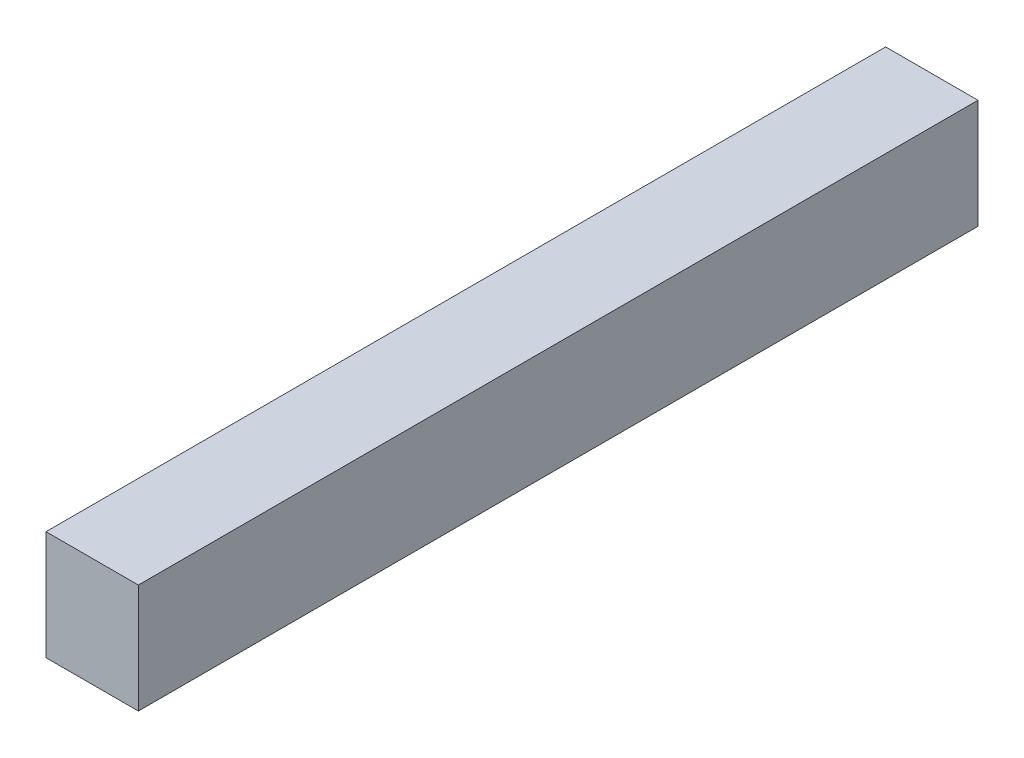
ISO-10303-21;
HEADER;
FILE_DESCRIPTION(('STEP AP214'),'2;1');
FILE_NAME('part.step','',(''),(''),'','','');
FILE_SCHEMA(('AUTOMOTIVE_DESIGN { 1 0 10303 214 1 1 1 1 }'));
ENDSEC;
DATA;
#1=APPLICATION_CONTEXT('core data for automotive mechanical design processes');
#2=APPLICATION_PROTOCOL_DEFINITION('international standard','automotive_design',2000,#1);
#3=PRODUCT_CONTEXT('',#1,'mechanical');
#4=PRODUCT('Part','Part','',(#3));
#5=PRODUCT_RELATED_PRODUCT_CATEGORY('part','',(#4));
#6=PRODUCT_DEFINITION_FORMATION('','',#4);
#7=PRODUCT_DEFINITION_CONTEXT('part definition',#1,'design');
#8=PRODUCT_DEFINITION('design','',#6,#7);
#9=PRODUCT_DEFINITION_SHAPE('','',#8);
#10=(LENGTH_UNIT() NAMED_UNIT(*) SI_UNIT(.MILLI.,.METRE.));
#11=(NAMED_UNIT(*) PLANE_ANGLE_UNIT() SI_UNIT($,.RADIAN.));
#12=(NAMED_UNIT(*) SI_UNIT($,.STERADIAN.) SOLID_ANGLE_UNIT());
#13=UNCERTAINTY_MEASURE_WITH_UNIT(LENGTH_MEASURE(1.E-05),#10,'distance_accuracy_value','');
#14=(GEOMETRIC_REPRESENTATION_CONTEXT(3) GLOBAL_UNCERTAINTY_ASSIGNED_CONTEXT((#13)) GLOBAL_UNIT_ASSIGNED_CONTEXT((#10,
#11,#12)) REPRESENTATION_CONTEXT('',''));
#15=CARTESIAN_POINT('',(0.,0.,0.));
#16=DIRECTION('',(0.,0.,1.));
#17=DIRECTION('',(1.,0.,0.));
#18=AXIS2_PLACEMENT_3D('',#15,#16,#17);
#19=CARTESIAN_POINT('',(1.375,1.625,25.));
#20=DIRECTION('',(-1.,0.,0.));
#21=DIRECTION('',(0.,-1.,0.));
#22=AXIS2_PLACEMENT_3D('',#19,#20,#21);
#23=PLANE('',#22);
#24=DIRECTION('',(0.,1.,0.));
#25=VECTOR('',#24,1.);
#26=CARTESIAN_POINT('',(1.375,1.625,0.));
#27=LINE('',#26,#25);
#28=CARTESIAN_POINT('',(1.375,-1.625,0.));
#29=VERTEX_POINT('',#28);
#30=CARTESIAN_POINT('',(1.375,1.625,0.));
#31=VERTEX_POINT('',#30);
#32=EDGE_CURVE('E107',#29,#31,#27,.T.);
#33=ORIENTED_EDGE('',*,*,#32,.T.);
#34=DIRECTION('',(0.,0.,-1.));
#35=VECTOR('',#34,1.);
#36=CARTESIAN_POINT('',(1.375,1.625,25.));
#37=LINE('',#36,#35);
#38=CARTESIAN_POINT('',(1.375,1.625,25.));
#39=VERTEX_POINT('',#38);
#40=EDGE_CURVE('E11',#39,#31,#37,.T.);
#41=ORIENTED_EDGE('',*,*,#40,.F.);
#42=DIRECTION('',(0.,1.,0.));
#43=VECTOR('',#42,1.);
#44=CARTESIAN_POINT('',(1.375,1.625,25.));
#45=LINE('',#44,#43);
#46=CARTESIAN_POINT('',(1.375,-1.625,25.));
#47=VERTEX_POINT('',#46);
#48=EDGE_CURVE('E91',#47,#39,#45,.T.);
#49=ORIENTED_EDGE('',*,*,#48,.F.);
#50=DIRECTION('',(0.,0.,-1.));
#51=VECTOR('',#50,1.);
#52=CARTESIAN_POINT('',(1.375,-1.625,25.));
#53=LINE('',#52,#51);
#54=EDGE_CURVE('E103',#47,#29,#53,.T.);
#55=ORIENTED_EDGE('',*,*,#54,.T.);
#56=EDGE_LOOP('',(#33,#41,#49,#55));
#57=FACE_BOUND('',#56,.T.);
#58=ADVANCED_FACE('F39',(#57),#23,.F.);
#59=CARTESIAN_POINT('',(-1.375,1.625,25.));
#60=DIRECTION('',(0.,-1.,0.));
#61=DIRECTION('',(0.,0.,-1.));
#62=AXIS2_PLACEMENT_3D('',#59,#60,#61);
#63=PLANE('',#62);
#64=DIRECTION('',(-1.,0.,0.));
#65=VECTOR('',#64,1.);
#66=CARTESIAN_POINT('',(-1.375,1.625,0.));
#67=LINE('',#66,#65);
#68=CARTESIAN_POINT('',(-1.375,1.625,0.));
#69=VERTEX_POINT('',#68);
#70=EDGE_CURVE('E96',#31,#69,#67,.T.);
#71=ORIENTED_EDGE('',*,*,#70,.T.);
#72=DIRECTION('',(0.,0.,-1.));
#73=VECTOR('',#72,1.);
#74=CARTESIAN_POINT('',(-1.375,1.625,25.));
#75=LINE('',#74,#73);
#76=CARTESIAN_POINT('',(-1.375,1.625,25.));
#77=VERTEX_POINT('',#76);
#78=EDGE_CURVE('E48',#77,#69,#75,.T.);
#79=ORIENTED_EDGE('',*,*,#78,.F.);
#80=DIRECTION('',(-1.,0.,0.));
#81=VECTOR('',#80,1.);
#82=CARTESIAN_POINT('',(-1.375,1.625,25.));
#83=LINE('',#82,#81);
#84=EDGE_CURVE('E86',#39,#77,#83,.T.);
#85=ORIENTED_EDGE('',*,*,#84,.F.);
#86=ORIENTED_EDGE('',*,*,#40,.T.);
#87=EDGE_LOOP('',(#71,#79,#85,#86));
#88=FACE_BOUND('',#87,.T.);
#89=ADVANCED_FACE('F95',(#88),#63,.F.);
#90=CARTESIAN_POINT('',(-1.375,1.625,25.));
#91=DIRECTION('',(1.,0.,0.));
#92=DIRECTION('',(0.,1.,0.));
#93=AXIS2_PLACEMENT_3D('',#90,#91,#92);
#94=PLANE('',#93);
#95=DIRECTION('',(0.,-1.,0.));
#96=VECTOR('',#95,1.);
#97=CARTESIAN_POINT('',(-1.375,1.625,0.));
#98=LINE('',#97,#96);
#99=CARTESIAN_POINT('',(-1.375,-1.625,0.));
#100=VERTEX_POINT('',#99);
#101=EDGE_CURVE('E73',#69,#100,#98,.T.);
#102=ORIENTED_EDGE('',*,*,#101,.T.);
#103=DIRECTION('',(0.,0.,-1.));
#104=VECTOR('',#103,1.);
#105=CARTESIAN_POINT('',(-1.375,-1.625,25.));
#106=LINE('',#105,#104);
#107=CARTESIAN_POINT('',(-1.375,-1.625,25.));
#108=VERTEX_POINT('',#107);
#109=EDGE_CURVE('E98',#108,#100,#106,.T.);
#110=ORIENTED_EDGE('',*,*,#109,.F.);
#111=DIRECTION('',(0.,-1.,0.));
#112=VECTOR('',#111,1.);
#113=CARTESIAN_POINT('',(-1.375,1.625,25.));
#114=LINE('',#113,#112);
#115=EDGE_CURVE('E89',#77,#108,#114,.T.);
#116=ORIENTED_EDGE('',*,*,#115,.F.);
#117=ORIENTED_EDGE('',*,*,#78,.T.);
#118=EDGE_LOOP('',(#102,#110,#116,#117));
#119=FACE_BOUND('',#118,.T.);
#120=ADVANCED_FACE('F99',(#119),#94,.F.);
#121=CARTESIAN_POINT('',(-1.375,-1.625,25.));
#122=DIRECTION('',(0.,1.,0.));
#123=DIRECTION('',(0.,0.,1.));
#124=AXIS2_PLACEMENT_3D('',#121,#122,#123);
#125=PLANE('',#124);
#126=DIRECTION('',(1.,0.,0.));
#127=VECTOR('',#126,1.);
#128=CARTESIAN_POINT('',(-1.375,-1.625,0.));
#129=LINE('',#128,#127);
#130=EDGE_CURVE('E79',#100,#29,#129,.T.);
#131=ORIENTED_EDGE('',*,*,#130,.T.);
#132=ORIENTED_EDGE('',*,*,#54,.F.);
#133=DIRECTION('',(1.,0.,0.));
#134=VECTOR('',#133,1.);
#135=CARTESIAN_POINT('',(-1.375,-1.625,25.));
#136=LINE('',#135,#134);
#137=EDGE_CURVE('E56',#108,#47,#136,.T.);
#138=ORIENTED_EDGE('',*,*,#137,.F.);
#139=ORIENTED_EDGE('',*,*,#109,.T.);
#140=EDGE_LOOP('',(#131,#132,#138,#139));
#141=FACE_BOUND('',#140,.T.);
#142=ADVANCED_FACE('F120',(#141),#125,.F.);
#143=CARTESIAN_POINT('',(0.,0.,25.));
#144=DIRECTION('',(0.,0.,1.));
#145=DIRECTION('',(1.,0.,0.));
#146=AXIS2_PLACEMENT_3D('',#143,#144,#145);
#147=PLANE('',#146);
#148=ORIENTED_EDGE('',*,*,#48,.T.);
#149=ORIENTED_EDGE('',*,*,#84,.T.);
#150=ORIENTED_EDGE('',*,*,#115,.T.);
#151=ORIENTED_EDGE('',*,*,#137,.T.);
#152=EDGE_LOOP('',(#148,#149,#150,#151));
#153=FACE_BOUND('',#152,.T.);
#154=ADVANCED_FACE('F87',(#153),#147,.T.);
#155=CARTESIAN_POINT('',(0.,0.,0.));
#156=DIRECTION('',(0.,0.,1.));
#157=DIRECTION('',(1.,0.,0.));
#158=AXIS2_PLACEMENT_3D('',#155,#156,#157);
#159=PLANE('',#158);
#160=ORIENTED_EDGE('',*,*,#32,.F.);
#161=ORIENTED_EDGE('',*,*,#130,.F.);
#162=ORIENTED_EDGE('',*,*,#101,.F.);
#163=ORIENTED_EDGE('',*,*,#70,.F.);
#164=EDGE_LOOP('',(#160,#161,#162,#163));
#165=FACE_BOUND('',#164,.T.);
#166=ADVANCED_FACE('F123',(#165),#159,.F.);
#167=CLOSED_SHELL('',(#58,#89,#120,#142,#154,#166));
#168=MANIFOLD_SOLID_BREP('B2',#167);
#169=ADVANCED_BREP_SHAPE_REPRESENTATION('',(#18,#168),#14);
#170=SHAPE_DEFINITION_REPRESENTATION(#9,#169);
ENDSEC;
END-ISO-10303-21;
